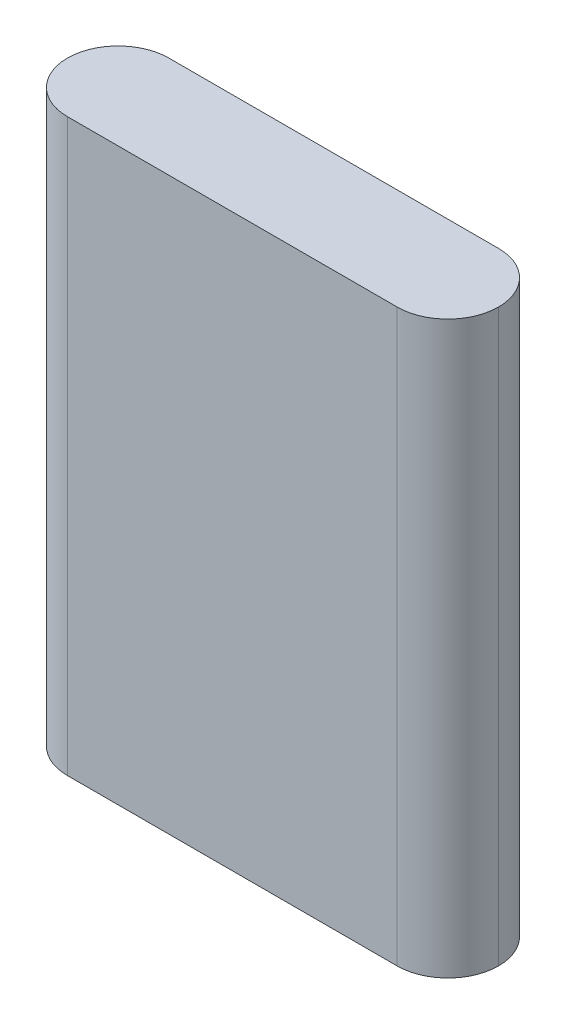
ISO-10303-21;
HEADER;
FILE_DESCRIPTION(('STEP AP214'),'2;1');
FILE_NAME('part.step','',(''),(''),'','','');
FILE_SCHEMA(('AUTOMOTIVE_DESIGN { 1 0 10303 214 1 1 1 1 }'));
ENDSEC;
DATA;
#1=APPLICATION_CONTEXT('core data for automotive mechanical design processes');
#2=APPLICATION_PROTOCOL_DEFINITION('international standard','automotive_design',2000,#1);
#3=PRODUCT_CONTEXT('',#1,'mechanical');
#4=PRODUCT('Part','Part','',(#3));
#5=PRODUCT_RELATED_PRODUCT_CATEGORY('part','',(#4));
#6=PRODUCT_DEFINITION_FORMATION('','',#4);
#7=PRODUCT_DEFINITION_CONTEXT('part definition',#1,'design');
#8=PRODUCT_DEFINITION('design','',#6,#7);
#9=PRODUCT_DEFINITION_SHAPE('','',#8);
#10=(LENGTH_UNIT() NAMED_UNIT(*) SI_UNIT(.MILLI.,.METRE.));
#11=(NAMED_UNIT(*) PLANE_ANGLE_UNIT() SI_UNIT($,.RADIAN.));
#12=(NAMED_UNIT(*) SI_UNIT($,.STERADIAN.) SOLID_ANGLE_UNIT());
#13=UNCERTAINTY_MEASURE_WITH_UNIT(LENGTH_MEASURE(1.E-05),#10,'distance_accuracy_value','');
#14=(GEOMETRIC_REPRESENTATION_CONTEXT(3) GLOBAL_UNCERTAINTY_ASSIGNED_CONTEXT((#13)) GLOBAL_UNIT_ASSIGNED_CONTEXT((#10,
#11,#12)) REPRESENTATION_CONTEXT('',''));
#15=CARTESIAN_POINT('',(0.,0.,0.));
#16=DIRECTION('',(0.,0.,1.));
#17=DIRECTION('',(1.,0.,0.));
#18=AXIS2_PLACEMENT_3D('',#15,#16,#17);
#19=CARTESIAN_POINT('',(0.,0.,8.));
#20=DIRECTION('',(0.,1.,0.));
#21=DIRECTION('',(0.,0.,1.));
#22=AXIS2_PLACEMENT_3D('',#19,#20,#21);
#23=PLANE('',#22);
#24=CARTESIAN_POINT('',(30.,0.,4.));
#25=DIRECTION('',(0.,1.,0.));
#26=DIRECTION('',(0.,0.,1.));
#27=AXIS2_PLACEMENT_3D('',#24,#25,#26);
#28=CIRCLE('',#27,4.);
#29=CARTESIAN_POINT('',(30.,0.,0.));
#30=VERTEX_POINT('',#29);
#31=CARTESIAN_POINT('',(34.,0.,4.));
#32=VERTEX_POINT('',#31);
#33=EDGE_CURVE('E63',#30,#32,#28,.F.);
#34=ORIENTED_EDGE('',*,*,#33,.T.);
#35=CARTESIAN_POINT('',(30.,0.,4.));
#36=DIRECTION('',(0.,1.,0.));
#37=DIRECTION('',(0.,0.,1.));
#38=AXIS2_PLACEMENT_3D('',#35,#36,#37);
#39=CIRCLE('',#38,4.);
#40=CARTESIAN_POINT('',(30.,0.,8.));
#41=VERTEX_POINT('',#40);
#42=EDGE_CURVE('E107',#32,#41,#39,.F.);
#43=ORIENTED_EDGE('',*,*,#42,.T.);
#44=DIRECTION('',(1.,0.,0.));
#45=VECTOR('',#44,1.);
#46=CARTESIAN_POINT('',(0.,0.,8.));
#47=LINE('',#46,#45);
#48=CARTESIAN_POINT('',(4.,0.,8.));
#49=VERTEX_POINT('',#48);
#50=EDGE_CURVE('E98',#49,#41,#47,.T.);
#51=ORIENTED_EDGE('',*,*,#50,.F.);
#52=CARTESIAN_POINT('',(4.,0.,4.));
#53=DIRECTION('',(0.,1.,0.));
#54=DIRECTION('',(0.,0.,1.));
#55=AXIS2_PLACEMENT_3D('',#52,#53,#54);
#56=CIRCLE('',#55,4.);
#57=CARTESIAN_POINT('',(0.,0.,4.));
#58=VERTEX_POINT('',#57);
#59=EDGE_CURVE('E56',#49,#58,#56,.F.);
#60=ORIENTED_EDGE('',*,*,#59,.T.);
#61=CARTESIAN_POINT('',(4.,0.,4.));
#62=DIRECTION('',(0.,1.,0.));
#63=DIRECTION('',(0.,0.,1.));
#64=AXIS2_PLACEMENT_3D('',#61,#62,#63);
#65=CIRCLE('',#64,4.);
#66=CARTESIAN_POINT('',(4.,0.,0.));
#67=VERTEX_POINT('',#66);
#68=EDGE_CURVE('E112',#58,#67,#65,.F.);
#69=ORIENTED_EDGE('',*,*,#68,.T.);
#70=DIRECTION('',(1.,0.,0.));
#71=VECTOR('',#70,1.);
#72=CARTESIAN_POINT('',(0.,0.,0.));
#73=LINE('',#72,#71);
#74=EDGE_CURVE('E125',#67,#30,#73,.T.);
#75=ORIENTED_EDGE('',*,*,#74,.T.);
#76=EDGE_LOOP('',(#34,#43,#51,#60,#69,#75));
#77=FACE_BOUND('',#76,.T.);
#78=ADVANCED_FACE('F39',(#77),#23,.F.);
#79=CARTESIAN_POINT('',(0.,45.,8.));
#80=DIRECTION('',(0.,-1.,0.));
#81=DIRECTION('',(0.,0.,-1.));
#82=AXIS2_PLACEMENT_3D('',#79,#80,#81);
#83=PLANE('',#82);
#84=DIRECTION('',(-1.,0.,0.));
#85=VECTOR('',#84,1.);
#86=CARTESIAN_POINT('',(0.,45.,8.));
#87=LINE('',#86,#85);
#88=CARTESIAN_POINT('',(30.,45.,8.));
#89=VERTEX_POINT('',#88);
#90=CARTESIAN_POINT('',(4.,45.,8.));
#91=VERTEX_POINT('',#90);
#92=EDGE_CURVE('E101',#89,#91,#87,.T.);
#93=ORIENTED_EDGE('',*,*,#92,.F.);
#94=CARTESIAN_POINT('',(30.,45.,4.));
#95=DIRECTION('',(0.,-1.,0.));
#96=DIRECTION('',(0.,0.,-1.));
#97=AXIS2_PLACEMENT_3D('',#94,#95,#96);
#98=CIRCLE('',#97,4.);
#99=CARTESIAN_POINT('',(34.,45.,4.));
#100=VERTEX_POINT('',#99);
#101=EDGE_CURVE('E113',#89,#100,#98,.F.);
#102=ORIENTED_EDGE('',*,*,#101,.T.);
#103=CARTESIAN_POINT('',(30.,45.,4.));
#104=DIRECTION('',(0.,-1.,0.));
#105=DIRECTION('',(0.,0.,-1.));
#106=AXIS2_PLACEMENT_3D('',#103,#104,#105);
#107=CIRCLE('',#106,4.);
#108=CARTESIAN_POINT('',(30.,45.,0.));
#109=VERTEX_POINT('',#108);
#110=EDGE_CURVE('E116',#100,#109,#107,.F.);
#111=ORIENTED_EDGE('',*,*,#110,.T.);
#112=DIRECTION('',(-1.,0.,0.));
#113=VECTOR('',#112,1.);
#114=CARTESIAN_POINT('',(0.,45.,0.));
#115=LINE('',#114,#113);
#116=CARTESIAN_POINT('',(4.,45.,0.));
#117=VERTEX_POINT('',#116);
#118=EDGE_CURVE('E108',#109,#117,#115,.T.);
#119=ORIENTED_EDGE('',*,*,#118,.T.);
#120=CARTESIAN_POINT('',(4.,45.,4.));
#121=DIRECTION('',(0.,-1.,0.));
#122=DIRECTION('',(0.,0.,-1.));
#123=AXIS2_PLACEMENT_3D('',#120,#121,#122);
#124=CIRCLE('',#123,4.);
#125=CARTESIAN_POINT('',(0.,45.,4.));
#126=VERTEX_POINT('',#125);
#127=EDGE_CURVE('E131',#117,#126,#124,.F.);
#128=ORIENTED_EDGE('',*,*,#127,.T.);
#129=CARTESIAN_POINT('',(4.,45.,4.));
#130=DIRECTION('',(0.,-1.,0.));
#131=DIRECTION('',(0.,0.,-1.));
#132=AXIS2_PLACEMENT_3D('',#129,#130,#131);
#133=CIRCLE('',#132,4.);
#134=EDGE_CURVE('E142',#126,#91,#133,.F.);
#135=ORIENTED_EDGE('',*,*,#134,.T.);
#136=EDGE_LOOP('',(#93,#102,#111,#119,#128,#135));
#137=FACE_BOUND('',#136,.T.);
#138=ADVANCED_FACE('F148',(#137),#83,.F.);
#139=CARTESIAN_POINT('',(0.,0.,8.));
#140=DIRECTION('',(0.,0.,-1.));
#141=DIRECTION('',(-1.,0.,0.));
#142=AXIS2_PLACEMENT_3D('',#139,#140,#141);
#143=PLANE('',#142);
#144=ORIENTED_EDGE('',*,*,#50,.T.);
#145=DIRECTION('',(0.,1.,0.));
#146=VECTOR('',#145,1.);
#147=CARTESIAN_POINT('',(30.,0.,8.));
#148=LINE('',#147,#146);
#149=EDGE_CURVE('E104',#41,#89,#148,.T.);
#150=ORIENTED_EDGE('',*,*,#149,.T.);
#151=ORIENTED_EDGE('',*,*,#92,.T.);
#152=DIRECTION('',(0.,-1.,0.));
#153=VECTOR('',#152,1.);
#154=CARTESIAN_POINT('',(4.,0.,8.));
#155=LINE('',#154,#153);
#156=EDGE_CURVE('E95',#91,#49,#155,.T.);
#157=ORIENTED_EDGE('',*,*,#156,.T.);
#158=EDGE_LOOP('',(#144,#150,#151,#157));
#159=FACE_BOUND('',#158,.T.);
#160=ADVANCED_FACE('F96',(#159),#143,.F.);
#161=CARTESIAN_POINT('',(0.,0.,0.));
#162=DIRECTION('',(0.,0.,-1.));
#163=DIRECTION('',(-1.,0.,0.));
#164=AXIS2_PLACEMENT_3D('',#161,#162,#163);
#165=PLANE('',#164);
#166=ORIENTED_EDGE('',*,*,#118,.F.);
#167=DIRECTION('',(0.,1.,0.));
#168=VECTOR('',#167,1.);
#169=CARTESIAN_POINT('',(30.,0.,0.));
#170=LINE('',#169,#168);
#171=EDGE_CURVE('E11',#109,#30,#170,.F.);
#172=ORIENTED_EDGE('',*,*,#171,.T.);
#173=ORIENTED_EDGE('',*,*,#74,.F.);
#174=DIRECTION('',(0.,-1.,0.));
#175=VECTOR('',#174,1.);
#176=CARTESIAN_POINT('',(4.,45.,0.));
#177=LINE('',#176,#175);
#178=EDGE_CURVE('E48',#67,#117,#177,.F.);
#179=ORIENTED_EDGE('',*,*,#178,.T.);
#180=EDGE_LOOP('',(#166,#172,#173,#179));
#181=FACE_BOUND('',#180,.T.);
#182=ADVANCED_FACE('F135',(#181),#165,.T.);
#183=CARTESIAN_POINT('',(30.,0.,4.));
#184=DIRECTION('',(0.,-1.,0.));
#185=DIRECTION('',(0.,0.,-1.));
#186=AXIS2_PLACEMENT_3D('',#183,#184,#185);
#187=CYLINDRICAL_SURFACE('',#186,4.);
#188=DIRECTION('',(0.,1.,0.));
#189=VECTOR('',#188,1.);
#190=CARTESIAN_POINT('',(34.,45.,4.));
#191=LINE('',#190,#189);
#192=EDGE_CURVE('E123',#32,#100,#191,.T.);
#193=ORIENTED_EDGE('',*,*,#192,.F.);
#194=ORIENTED_EDGE('',*,*,#33,.F.);
#195=ORIENTED_EDGE('',*,*,#171,.F.);
#196=ORIENTED_EDGE('',*,*,#110,.F.);
#197=EDGE_LOOP('',(#193,#194,#195,#196));
#198=FACE_BOUND('',#197,.T.);
#199=ADVANCED_FACE('F140',(#198),#187,.T.);
#200=CARTESIAN_POINT('',(30.,0.,4.));
#201=DIRECTION('',(0.,1.,0.));
#202=DIRECTION('',(0.,0.,1.));
#203=AXIS2_PLACEMENT_3D('',#200,#201,#202);
#204=CYLINDRICAL_SURFACE('',#203,4.);
#205=ORIENTED_EDGE('',*,*,#42,.F.);
#206=ORIENTED_EDGE('',*,*,#192,.T.);
#207=ORIENTED_EDGE('',*,*,#101,.F.);
#208=ORIENTED_EDGE('',*,*,#149,.F.);
#209=EDGE_LOOP('',(#205,#206,#207,#208));
#210=FACE_BOUND('',#209,.T.);
#211=ADVANCED_FACE('F141',(#210),#204,.T.);
#212=CARTESIAN_POINT('',(4.,0.,4.));
#213=DIRECTION('',(0.,-1.,0.));
#214=DIRECTION('',(0.,0.,-1.));
#215=AXIS2_PLACEMENT_3D('',#212,#213,#214);
#216=CYLINDRICAL_SURFACE('',#215,4.);
#217=ORIENTED_EDGE('',*,*,#156,.F.);
#218=ORIENTED_EDGE('',*,*,#134,.F.);
#219=DIRECTION('',(0.,-1.,0.));
#220=VECTOR('',#219,1.);
#221=CARTESIAN_POINT('',(0.,0.,4.));
#222=LINE('',#221,#220);
#223=EDGE_CURVE('E43',#58,#126,#222,.F.);
#224=ORIENTED_EDGE('',*,*,#223,.F.);
#225=ORIENTED_EDGE('',*,*,#59,.F.);
#226=EDGE_LOOP('',(#217,#218,#224,#225));
#227=FACE_BOUND('',#226,.T.);
#228=ADVANCED_FACE('F41',(#227),#216,.T.);
#229=CARTESIAN_POINT('',(4.,0.,4.));
#230=DIRECTION('',(0.,1.,0.));
#231=DIRECTION('',(0.,0.,1.));
#232=AXIS2_PLACEMENT_3D('',#229,#230,#231);
#233=CYLINDRICAL_SURFACE('',#232,4.);
#234=ORIENTED_EDGE('',*,*,#127,.F.);
#235=ORIENTED_EDGE('',*,*,#178,.F.);
#236=ORIENTED_EDGE('',*,*,#68,.F.);
#237=ORIENTED_EDGE('',*,*,#223,.T.);
#238=EDGE_LOOP('',(#234,#235,#236,#237));
#239=FACE_BOUND('',#238,.T.);
#240=ADVANCED_FACE('F129',(#239),#233,.T.);
#241=CLOSED_SHELL('',(#78,#138,#160,#182,#199,#211,#228,#240));
#242=MANIFOLD_SOLID_BREP('B2',#241);
#243=ADVANCED_BREP_SHAPE_REPRESENTATION('',(#18,#242),#14);
#244=SHAPE_DEFINITION_REPRESENTATION(#9,#243);
ENDSEC;
END-ISO-10303-21;
